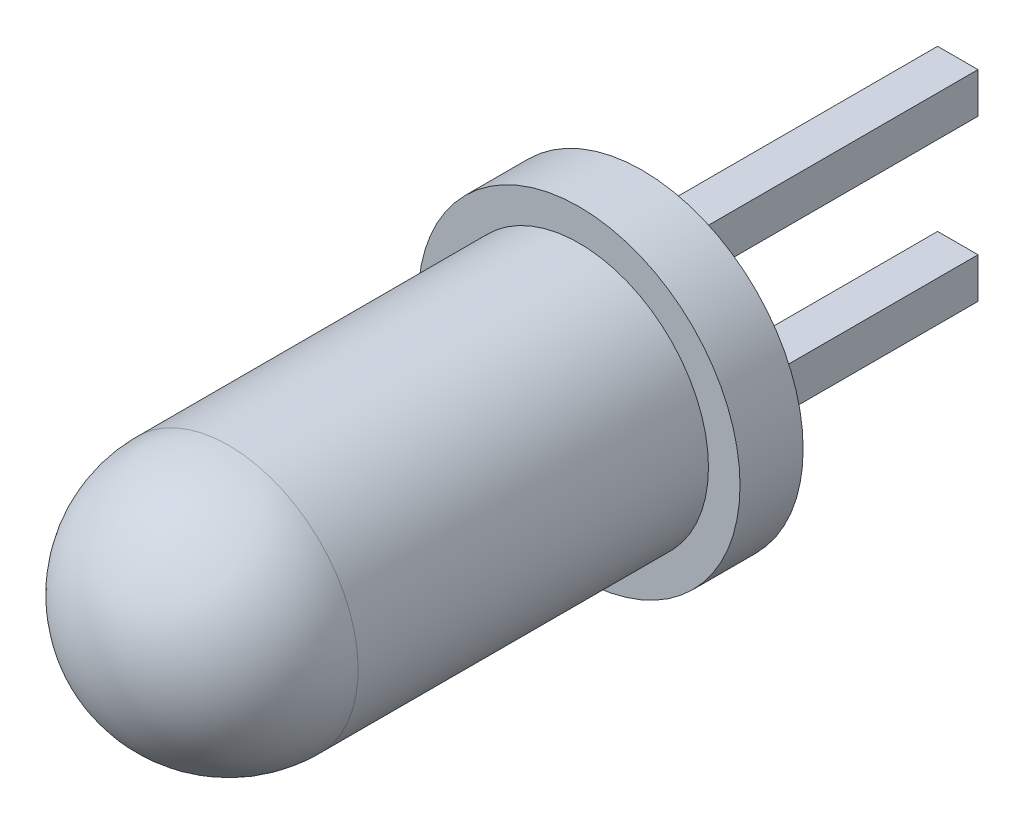
ISO-10303-21;
HEADER;
FILE_DESCRIPTION(('STEP AP214'),'2;1');
FILE_NAME('part.step','',(''),(''),'','','');
FILE_SCHEMA(('AUTOMOTIVE_DESIGN { 1 0 10303 214 1 1 1 1 }'));
ENDSEC;
DATA;
#1=APPLICATION_CONTEXT('core data for automotive mechanical design processes');
#2=APPLICATION_PROTOCOL_DEFINITION('international standard','automotive_design',2000,#1);
#3=PRODUCT_CONTEXT('',#1,'mechanical');
#4=PRODUCT('Part','Part','',(#3));
#5=PRODUCT_RELATED_PRODUCT_CATEGORY('part','',(#4));
#6=PRODUCT_DEFINITION_FORMATION('','',#4);
#7=PRODUCT_DEFINITION_CONTEXT('part definition',#1,'design');
#8=PRODUCT_DEFINITION('design','',#6,#7);
#9=PRODUCT_DEFINITION_SHAPE('','',#8);
#10=(LENGTH_UNIT() NAMED_UNIT(*) SI_UNIT(.MILLI.,.METRE.));
#11=(NAMED_UNIT(*) PLANE_ANGLE_UNIT() SI_UNIT($,.RADIAN.));
#12=(NAMED_UNIT(*) SI_UNIT($,.STERADIAN.) SOLID_ANGLE_UNIT());
#13=UNCERTAINTY_MEASURE_WITH_UNIT(LENGTH_MEASURE(1.E-05),#10,'distance_accuracy_value','');
#14=(GEOMETRIC_REPRESENTATION_CONTEXT(3) GLOBAL_UNCERTAINTY_ASSIGNED_CONTEXT((#13)) GLOBAL_UNIT_ASSIGNED_CONTEXT((#10,
#11,#12)) REPRESENTATION_CONTEXT('',''));
#15=CARTESIAN_POINT('',(0.,0.,0.));
#16=DIRECTION('',(0.,0.,1.));
#17=DIRECTION('',(1.,0.,0.));
#18=AXIS2_PLACEMENT_3D('',#15,#16,#17);
#19=CARTESIAN_POINT('',(0.,0.,0.));
#20=DIRECTION('',(0.,0.,-1.));
#21=DIRECTION('',(-1.,0.,0.));
#22=AXIS2_PLACEMENT_3D('',#19,#20,#21);
#23=PLANE('',#22);
#24=DIRECTION('',(1.,0.,0.));
#25=VECTOR('',#24,1.);
#26=CARTESIAN_POINT('',(-0.32,0.95,0.));
#27=LINE('',#26,#25);
#28=CARTESIAN_POINT('',(-0.32,0.95,0.));
#29=VERTEX_POINT('',#28);
#30=CARTESIAN_POINT('',(0.32,0.95,0.));
#31=VERTEX_POINT('',#30);
#32=EDGE_CURVE('E129',#29,#31,#27,.T.);
#33=ORIENTED_EDGE('',*,*,#32,.T.);
#34=DIRECTION('',(0.,-1.,0.));
#35=VECTOR('',#34,1.);
#36=CARTESIAN_POINT('',(0.32,1.59,0.));
#37=LINE('',#36,#35);
#38=CARTESIAN_POINT('',(0.32,1.59,0.));
#39=VERTEX_POINT('',#38);
#40=EDGE_CURVE('E95',#39,#31,#37,.T.);
#41=ORIENTED_EDGE('',*,*,#40,.F.);
#42=DIRECTION('',(-1.,0.,0.));
#43=VECTOR('',#42,1.);
#44=CARTESIAN_POINT('',(0.32,1.59,0.));
#45=LINE('',#44,#43);
#46=CARTESIAN_POINT('',(-0.32,1.59,0.));
#47=VERTEX_POINT('',#46);
#48=EDGE_CURVE('E118',#39,#47,#45,.T.);
#49=ORIENTED_EDGE('',*,*,#48,.T.);
#50=DIRECTION('',(0.,1.,0.));
#51=VECTOR('',#50,1.);
#52=CARTESIAN_POINT('',(-0.32,0.95,0.));
#53=LINE('',#52,#51);
#54=EDGE_CURVE('E131',#29,#47,#53,.T.);
#55=ORIENTED_EDGE('',*,*,#54,.F.);
#56=EDGE_LOOP('',(#33,#41,#49,#55));
#57=FACE_BOUND('',#56,.T.);
#58=CARTESIAN_POINT('',(0.,0.,0.));
#59=DIRECTION('',(0.,0.,-1.));
#60=DIRECTION('',(-1.,0.,0.));
#61=AXIS2_PLACEMENT_3D('',#58,#59,#60);
#62=CIRCLE('',#61,2.55);
#63=CARTESIAN_POINT('',(-2.55,0.,0.));
#64=VERTEX_POINT('',#63);
#65=EDGE_CURVE('E9',#64,#64,#62,.T.);
#66=ORIENTED_EDGE('',*,*,#65,.T.);
#67=EDGE_LOOP('',(#66));
#68=FACE_BOUND('',#67,.T.);
#69=DIRECTION('',(1.,0.,0.));
#70=VECTOR('',#69,1.);
#71=CARTESIAN_POINT('',(-0.32,-1.59,0.));
#72=LINE('',#71,#70);
#73=CARTESIAN_POINT('',(-0.32,-1.59,0.));
#74=VERTEX_POINT('',#73);
#75=CARTESIAN_POINT('',(0.320000000000001,-1.59,0.));
#76=VERTEX_POINT('',#75);
#77=EDGE_CURVE('E29',#74,#76,#72,.T.);
#78=ORIENTED_EDGE('',*,*,#77,.T.);
#79=DIRECTION('',(0.,-1.,0.));
#80=VECTOR('',#79,1.);
#81=CARTESIAN_POINT('',(0.320000000000001,-0.95,0.));
#82=LINE('',#81,#80);
#83=CARTESIAN_POINT('',(0.320000000000001,-0.95,0.));
#84=VERTEX_POINT('',#83);
#85=EDGE_CURVE('E93',#84,#76,#82,.T.);
#86=ORIENTED_EDGE('',*,*,#85,.F.);
#87=DIRECTION('',(-1.,0.,0.));
#88=VECTOR('',#87,1.);
#89=CARTESIAN_POINT('',(0.320000000000001,-0.95,0.));
#90=LINE('',#89,#88);
#91=CARTESIAN_POINT('',(-0.32,-0.95,0.));
#92=VERTEX_POINT('',#91);
#93=EDGE_CURVE('E88',#84,#92,#90,.T.);
#94=ORIENTED_EDGE('',*,*,#93,.T.);
#95=DIRECTION('',(0.,1.,0.));
#96=VECTOR('',#95,1.);
#97=CARTESIAN_POINT('',(-0.32,-1.59,0.));
#98=LINE('',#97,#96);
#99=EDGE_CURVE('E34',#74,#92,#98,.T.);
#100=ORIENTED_EDGE('',*,*,#99,.F.);
#101=EDGE_LOOP('',(#78,#86,#94,#100));
#102=FACE_BOUND('',#101,.T.);
#103=ADVANCED_FACE('F15',(#57,#68,#102),#23,.T.);
#104=CARTESIAN_POINT('',(0.,0.,0.));
#105=DIRECTION('',(0.,0.,-1.));
#106=DIRECTION('',(-1.,0.,0.));
#107=AXIS2_PLACEMENT_3D('',#104,#105,#106);
#108=CYLINDRICAL_SURFACE('',#107,2.55);
#109=CARTESIAN_POINT('',(0.,0.,1.));
#110=DIRECTION('',(0.,0.,-1.));
#111=DIRECTION('',(-1.,0.,0.));
#112=AXIS2_PLACEMENT_3D('',#109,#110,#111);
#113=CIRCLE('',#112,2.55);
#114=CARTESIAN_POINT('',(-2.55,0.,1.));
#115=VERTEX_POINT('',#114);
#116=EDGE_CURVE('E22',#115,#115,#113,.T.);
#117=ORIENTED_EDGE('',*,*,#116,.T.);
#118=EDGE_LOOP('',(#117));
#119=FACE_BOUND('',#118,.T.);
#120=ORIENTED_EDGE('',*,*,#65,.F.);
#121=EDGE_LOOP('',(#120));
#122=FACE_BOUND('',#121,.T.);
#123=ADVANCED_FACE('F154',(#119,#122),#108,.T.);
#124=CARTESIAN_POINT('',(0.,2.55,1.));
#125=DIRECTION('',(0.,0.,1.));
#126=DIRECTION('',(1.,0.,0.));
#127=AXIS2_PLACEMENT_3D('',#124,#125,#126);
#128=PLANE('',#127);
#129=CARTESIAN_POINT('',(0.,0.,1.));
#130=DIRECTION('',(0.,0.,-1.));
#131=DIRECTION('',(-1.,0.,0.));
#132=AXIS2_PLACEMENT_3D('',#129,#130,#131);
#133=CIRCLE('',#132,2.05);
#134=CARTESIAN_POINT('',(-2.05,0.,1.));
#135=VERTEX_POINT('',#134);
#136=EDGE_CURVE('E149',#135,#135,#133,.T.);
#137=ORIENTED_EDGE('',*,*,#136,.T.);
#138=EDGE_LOOP('',(#137));
#139=FACE_BOUND('',#138,.T.);
#140=ORIENTED_EDGE('',*,*,#116,.F.);
#141=EDGE_LOOP('',(#140));
#142=FACE_BOUND('',#141,.T.);
#143=ADVANCED_FACE('F157',(#139,#142),#128,.T.);
#144=CARTESIAN_POINT('',(0.,0.,0.));
#145=DIRECTION('',(0.,0.,-1.));
#146=DIRECTION('',(-1.,0.,0.));
#147=AXIS2_PLACEMENT_3D('',#144,#145,#146);
#148=CYLINDRICAL_SURFACE('',#147,2.05);
#149=CARTESIAN_POINT('',(0.,0.,6.55));
#150=DIRECTION('',(0.,0.,-1.));
#151=DIRECTION('',(-1.,0.,0.));
#152=AXIS2_PLACEMENT_3D('',#149,#150,#151);
#153=CIRCLE('',#152,2.05);
#154=CARTESIAN_POINT('',(-2.05,0.,6.55));
#155=VERTEX_POINT('',#154);
#156=EDGE_CURVE('E146',#155,#155,#153,.T.);
#157=ORIENTED_EDGE('',*,*,#156,.T.);
#158=EDGE_LOOP('',(#157));
#159=FACE_BOUND('',#158,.T.);
#160=ORIENTED_EDGE('',*,*,#136,.F.);
#161=EDGE_LOOP('',(#160));
#162=FACE_BOUND('',#161,.T.);
#163=ADVANCED_FACE('F159',(#159,#162),#148,.T.);
#164=CARTESIAN_POINT('',(0.,0.,6.55));
#165=DIRECTION('',(0.,0.,-1.));
#166=DIRECTION('',(0.,1.,0.));
#167=AXIS2_PLACEMENT_3D('',#164,#165,#166);
#168=SPHERICAL_SURFACE('',#167,2.05);
#169=ORIENTED_EDGE('',*,*,#156,.F.);
#170=EDGE_LOOP('',(#169));
#171=FACE_BOUND('',#170,.T.);
#172=ADVANCED_FACE('F167',(#171),#168,.T.);
#173=CARTESIAN_POINT('',(0.32,1.59,-5.));
#174=DIRECTION('',(-1.,0.,0.));
#175=DIRECTION('',(0.,-1.,0.));
#176=AXIS2_PLACEMENT_3D('',#173,#174,#175);
#177=PLANE('',#176);
#178=ORIENTED_EDGE('',*,*,#40,.T.);
#179=DIRECTION('',(0.,0.,1.));
#180=VECTOR('',#179,1.);
#181=CARTESIAN_POINT('',(0.32,0.95,-5.));
#182=LINE('',#181,#180);
#183=CARTESIAN_POINT('',(0.32,0.95,-5.));
#184=VERTEX_POINT('',#183);
#185=EDGE_CURVE('E143',#184,#31,#182,.T.);
#186=ORIENTED_EDGE('',*,*,#185,.F.);
#187=DIRECTION('',(0.,-1.,0.));
#188=VECTOR('',#187,1.);
#189=CARTESIAN_POINT('',(0.32,1.59,-5.));
#190=LINE('',#189,#188);
#191=CARTESIAN_POINT('',(0.32,1.59,-5.));
#192=VERTEX_POINT('',#191);
#193=EDGE_CURVE('E115',#192,#184,#190,.T.);
#194=ORIENTED_EDGE('',*,*,#193,.F.);
#195=DIRECTION('',(0.,0.,1.));
#196=VECTOR('',#195,1.);
#197=CARTESIAN_POINT('',(0.32,1.59,-5.));
#198=LINE('',#197,#196);
#199=EDGE_CURVE('E126',#192,#39,#198,.T.);
#200=ORIENTED_EDGE('',*,*,#199,.T.);
#201=EDGE_LOOP('',(#178,#186,#194,#200));
#202=FACE_BOUND('',#201,.T.);
#203=ADVANCED_FACE('F183',(#202),#177,.F.);
#204=CARTESIAN_POINT('',(-0.32,0.95,-5.));
#205=DIRECTION('',(0.,-1.,0.));
#206=DIRECTION('',(1.,0.,0.));
#207=AXIS2_PLACEMENT_3D('',#204,#205,#206);
#208=PLANE('',#207);
#209=ORIENTED_EDGE('',*,*,#32,.F.);
#210=DIRECTION('',(0.,0.,1.));
#211=VECTOR('',#210,1.);
#212=CARTESIAN_POINT('',(-0.32,0.95,-5.));
#213=LINE('',#212,#211);
#214=CARTESIAN_POINT('',(-0.32,0.95,-5.));
#215=VERTEX_POINT('',#214);
#216=EDGE_CURVE('E140',#215,#29,#213,.T.);
#217=ORIENTED_EDGE('',*,*,#216,.F.);
#218=DIRECTION('',(1.,0.,0.));
#219=VECTOR('',#218,1.);
#220=CARTESIAN_POINT('',(-0.32,0.95,-5.));
#221=LINE('',#220,#219);
#222=EDGE_CURVE('E117',#215,#184,#221,.T.);
#223=ORIENTED_EDGE('',*,*,#222,.T.);
#224=ORIENTED_EDGE('',*,*,#185,.T.);
#225=EDGE_LOOP('',(#209,#217,#223,#224));
#226=FACE_BOUND('',#225,.T.);
#227=ADVANCED_FACE('F179',(#226),#208,.T.);
#228=CARTESIAN_POINT('',(-0.32,0.95,-5.));
#229=DIRECTION('',(1.,0.,0.));
#230=DIRECTION('',(0.,1.,0.));
#231=AXIS2_PLACEMENT_3D('',#228,#229,#230);
#232=PLANE('',#231);
#233=ORIENTED_EDGE('',*,*,#54,.T.);
#234=DIRECTION('',(0.,0.,1.));
#235=VECTOR('',#234,1.);
#236=CARTESIAN_POINT('',(-0.32,1.59,-5.));
#237=LINE('',#236,#235);
#238=CARTESIAN_POINT('',(-0.32,1.59,-5.));
#239=VERTEX_POINT('',#238);
#240=EDGE_CURVE('E137',#239,#47,#237,.T.);
#241=ORIENTED_EDGE('',*,*,#240,.F.);
#242=DIRECTION('',(0.,1.,0.));
#243=VECTOR('',#242,1.);
#244=CARTESIAN_POINT('',(-0.32,0.95,-5.));
#245=LINE('',#244,#243);
#246=EDGE_CURVE('E121',#215,#239,#245,.T.);
#247=ORIENTED_EDGE('',*,*,#246,.F.);
#248=ORIENTED_EDGE('',*,*,#216,.T.);
#249=EDGE_LOOP('',(#233,#241,#247,#248));
#250=FACE_BOUND('',#249,.T.);
#251=ADVANCED_FACE('F191',(#250),#232,.F.);
#252=CARTESIAN_POINT('',(0.32,1.59,-5.));
#253=DIRECTION('',(0.,1.,0.));
#254=DIRECTION('',(0.,0.,1.));
#255=AXIS2_PLACEMENT_3D('',#252,#253,#254);
#256=PLANE('',#255);
#257=ORIENTED_EDGE('',*,*,#48,.F.);
#258=ORIENTED_EDGE('',*,*,#199,.F.);
#259=DIRECTION('',(-1.,0.,0.));
#260=VECTOR('',#259,1.);
#261=CARTESIAN_POINT('',(0.32,1.59,-5.));
#262=LINE('',#261,#260);
#263=EDGE_CURVE('E123',#192,#239,#262,.T.);
#264=ORIENTED_EDGE('',*,*,#263,.T.);
#265=ORIENTED_EDGE('',*,*,#240,.T.);
#266=EDGE_LOOP('',(#257,#258,#264,#265));
#267=FACE_BOUND('',#266,.T.);
#268=ADVANCED_FACE('F187',(#267),#256,.T.);
#269=CARTESIAN_POINT('',(0.32,0.95,-5.));
#270=DIRECTION('',(0.,0.,1.));
#271=DIRECTION('',(1.,0.,0.));
#272=AXIS2_PLACEMENT_3D('',#269,#270,#271);
#273=PLANE('',#272);
#274=ORIENTED_EDGE('',*,*,#193,.T.);
#275=ORIENTED_EDGE('',*,*,#222,.F.);
#276=ORIENTED_EDGE('',*,*,#246,.T.);
#277=ORIENTED_EDGE('',*,*,#263,.F.);
#278=EDGE_LOOP('',(#274,#275,#276,#277));
#279=FACE_BOUND('',#278,.T.);
#280=ADVANCED_FACE('F193',(#279),#273,.F.);
#281=CARTESIAN_POINT('',(0.320000000000001,-0.95,-5.));
#282=DIRECTION('',(-1.,0.,0.));
#283=DIRECTION('',(0.,-1.,0.));
#284=AXIS2_PLACEMENT_3D('',#281,#282,#283);
#285=PLANE('',#284);
#286=ORIENTED_EDGE('',*,*,#85,.T.);
#287=DIRECTION('',(0.,0.,1.));
#288=VECTOR('',#287,1.);
#289=CARTESIAN_POINT('',(0.320000000000001,-1.59,-5.));
#290=LINE('',#289,#288);
#291=CARTESIAN_POINT('',(0.320000000000001,-1.59,-5.));
#292=VERTEX_POINT('',#291);
#293=EDGE_CURVE('E91',#292,#76,#290,.T.);
#294=ORIENTED_EDGE('',*,*,#293,.F.);
#295=DIRECTION('',(0.,-1.,0.));
#296=VECTOR('',#295,1.);
#297=CARTESIAN_POINT('',(0.320000000000001,-0.95,-5.));
#298=LINE('',#297,#296);
#299=CARTESIAN_POINT('',(0.320000000000001,-0.95,-5.));
#300=VERTEX_POINT('',#299);
#301=EDGE_CURVE('E79',#300,#292,#298,.T.);
#302=ORIENTED_EDGE('',*,*,#301,.F.);
#303=DIRECTION('',(0.,0.,1.));
#304=VECTOR('',#303,1.);
#305=CARTESIAN_POINT('',(0.320000000000001,-0.95,-5.));
#306=LINE('',#305,#304);
#307=EDGE_CURVE('E105',#300,#84,#306,.T.);
#308=ORIENTED_EDGE('',*,*,#307,.T.);
#309=EDGE_LOOP('',(#286,#294,#302,#308));
#310=FACE_BOUND('',#309,.T.);
#311=ADVANCED_FACE('F92',(#310),#285,.F.);
#312=CARTESIAN_POINT('',(-0.32,-1.59,-5.));
#313=DIRECTION('',(0.,-1.,0.));
#314=DIRECTION('',(1.,0.,0.));
#315=AXIS2_PLACEMENT_3D('',#312,#313,#314);
#316=PLANE('',#315);
#317=ORIENTED_EDGE('',*,*,#77,.F.);
#318=DIRECTION('',(0.,0.,1.));
#319=VECTOR('',#318,1.);
#320=CARTESIAN_POINT('',(-0.32,-1.59,-5.));
#321=LINE('',#320,#319);
#322=CARTESIAN_POINT('',(-0.32,-1.59,-5.));
#323=VERTEX_POINT('',#322);
#324=EDGE_CURVE('E96',#323,#74,#321,.T.);
#325=ORIENTED_EDGE('',*,*,#324,.F.);
#326=DIRECTION('',(1.,0.,0.));
#327=VECTOR('',#326,1.);
#328=CARTESIAN_POINT('',(-0.32,-1.59,-5.));
#329=LINE('',#328,#327);
#330=EDGE_CURVE('E83',#323,#292,#329,.T.);
#331=ORIENTED_EDGE('',*,*,#330,.T.);
#332=ORIENTED_EDGE('',*,*,#293,.T.);
#333=EDGE_LOOP('',(#317,#325,#331,#332));
#334=FACE_BOUND('',#333,.T.);
#335=ADVANCED_FACE('F98',(#334),#316,.T.);
#336=CARTESIAN_POINT('',(-0.32,-1.59,-5.));
#337=DIRECTION('',(1.,0.,0.));
#338=DIRECTION('',(0.,0.,-1.));
#339=AXIS2_PLACEMENT_3D('',#336,#337,#338);
#340=PLANE('',#339);
#341=ORIENTED_EDGE('',*,*,#99,.T.);
#342=DIRECTION('',(0.,0.,1.));
#343=VECTOR('',#342,1.);
#344=CARTESIAN_POINT('',(-0.32,-0.95,-5.));
#345=LINE('',#344,#343);
#346=CARTESIAN_POINT('',(-0.32,-0.95,-5.));
#347=VERTEX_POINT('',#346);
#348=EDGE_CURVE('E111',#347,#92,#345,.T.);
#349=ORIENTED_EDGE('',*,*,#348,.F.);
#350=DIRECTION('',(0.,1.,0.));
#351=VECTOR('',#350,1.);
#352=CARTESIAN_POINT('',(-0.32,-1.59,-5.));
#353=LINE('',#352,#351);
#354=EDGE_CURVE('E100',#323,#347,#353,.T.);
#355=ORIENTED_EDGE('',*,*,#354,.F.);
#356=ORIENTED_EDGE('',*,*,#324,.T.);
#357=EDGE_LOOP('',(#341,#349,#355,#356));
#358=FACE_BOUND('',#357,.T.);
#359=ADVANCED_FACE('F265',(#358),#340,.F.);
#360=CARTESIAN_POINT('',(0.320000000000001,-0.95,-5.));
#361=DIRECTION('',(0.,1.,0.));
#362=DIRECTION('',(-1.,0.,0.));
#363=AXIS2_PLACEMENT_3D('',#360,#361,#362);
#364=PLANE('',#363);
#365=ORIENTED_EDGE('',*,*,#93,.F.);
#366=ORIENTED_EDGE('',*,*,#307,.F.);
#367=DIRECTION('',(-1.,0.,0.));
#368=VECTOR('',#367,1.);
#369=CARTESIAN_POINT('',(0.320000000000001,-0.95,-5.));
#370=LINE('',#369,#368);
#371=EDGE_CURVE('E85',#300,#347,#370,.T.);
#372=ORIENTED_EDGE('',*,*,#371,.T.);
#373=ORIENTED_EDGE('',*,*,#348,.T.);
#374=EDGE_LOOP('',(#365,#366,#372,#373));
#375=FACE_BOUND('',#374,.T.);
#376=ADVANCED_FACE('F274',(#375),#364,.T.);
#377=CARTESIAN_POINT('',(0.320000000000001,-0.95,-5.));
#378=DIRECTION('',(0.,0.,-1.));
#379=DIRECTION('',(-1.,0.,0.));
#380=AXIS2_PLACEMENT_3D('',#377,#378,#379);
#381=PLANE('',#380);
#382=ORIENTED_EDGE('',*,*,#301,.T.);
#383=ORIENTED_EDGE('',*,*,#330,.F.);
#384=ORIENTED_EDGE('',*,*,#354,.T.);
#385=ORIENTED_EDGE('',*,*,#371,.F.);
#386=EDGE_LOOP('',(#382,#383,#384,#385));
#387=FACE_BOUND('',#386,.T.);
#388=ADVANCED_FACE('F81',(#387),#381,.T.);
#389=CLOSED_SHELL('',(#103,#123,#143,#163,#172,#203,#227,#251,#268,#280,#311,#335,#359,#376,#388));
#390=MANIFOLD_SOLID_BREP('B1',#389);
#391=ADVANCED_BREP_SHAPE_REPRESENTATION('',(#18,#390),#14);
#392=SHAPE_DEFINITION_REPRESENTATION(#9,#391);
ENDSEC;
END-ISO-10303-21;
